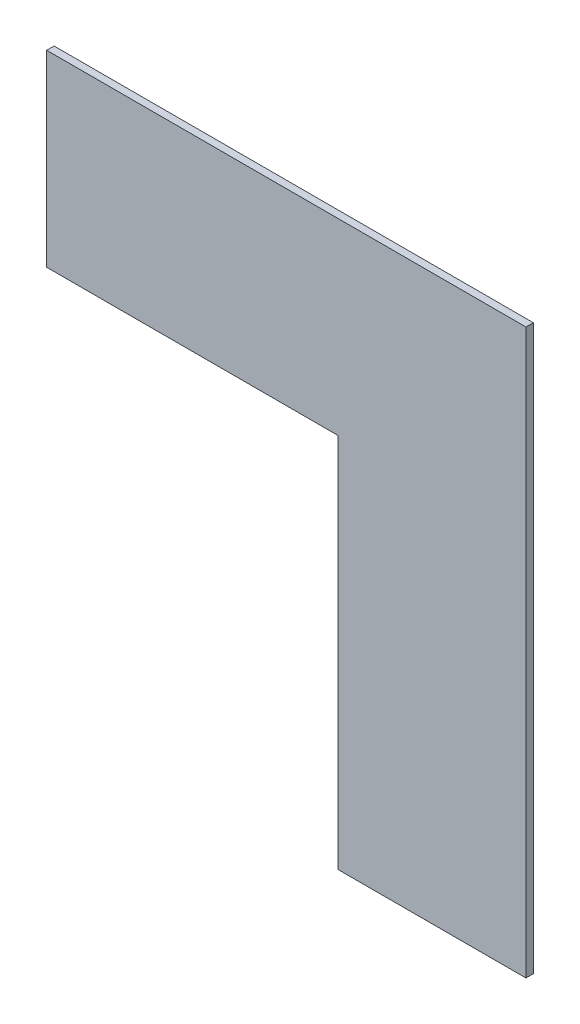
ISO-10303-21;
HEADER;
FILE_DESCRIPTION(('STEP AP214'),'2;1');
FILE_NAME('part.step','',(''),(''),'','','');
FILE_SCHEMA(('AUTOMOTIVE_DESIGN { 1 0 10303 214 1 1 1 1 }'));
ENDSEC;
DATA;
#1=APPLICATION_CONTEXT('core data for automotive mechanical design processes');
#2=APPLICATION_PROTOCOL_DEFINITION('international standard','automotive_design',2000,#1);
#3=PRODUCT_CONTEXT('',#1,'mechanical');
#4=PRODUCT('Part','Part','',(#3));
#5=PRODUCT_RELATED_PRODUCT_CATEGORY('part','',(#4));
#6=PRODUCT_DEFINITION_FORMATION('','',#4);
#7=PRODUCT_DEFINITION_CONTEXT('part definition',#1,'design');
#8=PRODUCT_DEFINITION('design','',#6,#7);
#9=PRODUCT_DEFINITION_SHAPE('','',#8);
#10=(LENGTH_UNIT() NAMED_UNIT(*) SI_UNIT(.MILLI.,.METRE.));
#11=(NAMED_UNIT(*) PLANE_ANGLE_UNIT() SI_UNIT($,.RADIAN.));
#12=(NAMED_UNIT(*) SI_UNIT($,.STERADIAN.) SOLID_ANGLE_UNIT());
#13=UNCERTAINTY_MEASURE_WITH_UNIT(LENGTH_MEASURE(1.E-05),#10,'distance_accuracy_value','');
#14=(GEOMETRIC_REPRESENTATION_CONTEXT(3) GLOBAL_UNCERTAINTY_ASSIGNED_CONTEXT((#13)) GLOBAL_UNIT_ASSIGNED_CONTEXT((#10,
#11,#12)) REPRESENTATION_CONTEXT('',''));
#15=CARTESIAN_POINT('',(0.,0.,0.));
#16=DIRECTION('',(0.,0.,1.));
#17=DIRECTION('',(1.,0.,0.));
#18=AXIS2_PLACEMENT_3D('',#15,#16,#17);
#19=CARTESIAN_POINT('',(-0.32385,0.381,0.01));
#20=DIRECTION('',(0.,0.,1.));
#21=DIRECTION('',(1.,0.,0.));
#22=AXIS2_PLACEMENT_3D('',#19,#20,#21);
#23=PLANE('',#22);
#24=DIRECTION('',(0.,1.,0.));
#25=VECTOR('',#24,1.);
#26=CARTESIAN_POINT('',(0.32385,0.381,0.01));
#27=LINE('',#26,#25);
#28=CARTESIAN_POINT('',(0.32385,0.381,0.01));
#29=VERTEX_POINT('',#28);
#30=CARTESIAN_POINT('',(0.32385,-0.381,0.01));
#31=VERTEX_POINT('',#30);
#32=EDGE_CURVE('E97',#29,#31,#27,.F.);
#33=ORIENTED_EDGE('',*,*,#32,.F.);
#34=DIRECTION('',(1.,0.,0.));
#35=VECTOR('',#34,1.);
#36=CARTESIAN_POINT('',(-0.32385,0.381,0.01));
#37=LINE('',#36,#35);
#38=CARTESIAN_POINT('',(-0.32385,0.381,0.01));
#39=VERTEX_POINT('',#38);
#40=EDGE_CURVE('E82',#39,#29,#37,.T.);
#41=ORIENTED_EDGE('',*,*,#40,.F.);
#42=DIRECTION('',(0.,1.,0.));
#43=VECTOR('',#42,1.);
#44=CARTESIAN_POINT('',(-0.32385,0.127,0.01));
#45=LINE('',#44,#43);
#46=CARTESIAN_POINT('',(-0.32385,0.127,0.01));
#47=VERTEX_POINT('',#46);
#48=EDGE_CURVE('E20',#47,#39,#45,.T.);
#49=ORIENTED_EDGE('',*,*,#48,.F.);
#50=DIRECTION('',(1.,0.,0.));
#51=VECTOR('',#50,1.);
#52=CARTESIAN_POINT('',(0.06985,0.127,0.01));
#53=LINE('',#52,#51);
#54=CARTESIAN_POINT('',(0.06985,0.127,0.01));
#55=VERTEX_POINT('',#54);
#56=EDGE_CURVE('E71',#55,#47,#53,.F.);
#57=ORIENTED_EDGE('',*,*,#56,.F.);
#58=DIRECTION('',(0.,1.,0.));
#59=VECTOR('',#58,1.);
#60=CARTESIAN_POINT('',(0.06985,-0.381,0.01));
#61=LINE('',#60,#59);
#62=CARTESIAN_POINT('',(0.06985,-0.381,0.01));
#63=VERTEX_POINT('',#62);
#64=EDGE_CURVE('E66',#63,#55,#61,.T.);
#65=ORIENTED_EDGE('',*,*,#64,.F.);
#66=DIRECTION('',(1.,0.,0.));
#67=VECTOR('',#66,1.);
#68=CARTESIAN_POINT('',(0.32385,-0.381,0.01));
#69=LINE('',#68,#67);
#70=EDGE_CURVE('E93',#31,#63,#69,.F.);
#71=ORIENTED_EDGE('',*,*,#70,.F.);
#72=EDGE_LOOP('',(#33,#41,#49,#57,#65,#71));
#73=FACE_BOUND('',#72,.T.);
#74=ADVANCED_FACE('F17',(#73),#23,.T.);
#75=CARTESIAN_POINT('',(-0.32385,0.127,0.));
#76=DIRECTION('',(-1.,0.,0.));
#77=DIRECTION('',(0.,0.,1.));
#78=AXIS2_PLACEMENT_3D('',#75,#76,#77);
#79=PLANE('',#78);
#80=DIRECTION('',(0.,0.,1.));
#81=VECTOR('',#80,1.);
#82=CARTESIAN_POINT('',(-0.32385,0.381,0.));
#83=LINE('',#82,#81);
#84=CARTESIAN_POINT('',(-0.32385,0.381,0.));
#85=VERTEX_POINT('',#84);
#86=EDGE_CURVE('E101',#85,#39,#83,.T.);
#87=ORIENTED_EDGE('',*,*,#86,.F.);
#88=DIRECTION('',(0.,1.,0.));
#89=VECTOR('',#88,1.);
#90=CARTESIAN_POINT('',(-0.32385,0.381,0.));
#91=LINE('',#90,#89);
#92=CARTESIAN_POINT('',(-0.32385,0.127,0.));
#93=VERTEX_POINT('',#92);
#94=EDGE_CURVE('E88',#85,#93,#91,.F.);
#95=ORIENTED_EDGE('',*,*,#94,.T.);
#96=DIRECTION('',(0.,0.,-1.));
#97=VECTOR('',#96,1.);
#98=CARTESIAN_POINT('',(-0.32385,0.127,0.));
#99=LINE('',#98,#97);
#100=EDGE_CURVE('E76',#47,#93,#99,.T.);
#101=ORIENTED_EDGE('',*,*,#100,.F.);
#102=ORIENTED_EDGE('',*,*,#48,.T.);
#103=EDGE_LOOP('',(#87,#95,#101,#102));
#104=FACE_BOUND('',#103,.T.);
#105=ADVANCED_FACE('F87',(#104),#79,.T.);
#106=CARTESIAN_POINT('',(0.06985,0.127,0.));
#107=DIRECTION('',(0.,-1.,0.));
#108=DIRECTION('',(0.,0.,-1.));
#109=AXIS2_PLACEMENT_3D('',#106,#107,#108);
#110=PLANE('',#109);
#111=ORIENTED_EDGE('',*,*,#100,.T.);
#112=DIRECTION('',(1.,0.,0.));
#113=VECTOR('',#112,1.);
#114=CARTESIAN_POINT('',(-0.32385,0.127,0.));
#115=LINE('',#114,#113);
#116=CARTESIAN_POINT('',(0.06985,0.127,0.));
#117=VERTEX_POINT('',#116);
#118=EDGE_CURVE('E106',#93,#117,#115,.T.);
#119=ORIENTED_EDGE('',*,*,#118,.T.);
#120=DIRECTION('',(0.,0.,1.));
#121=VECTOR('',#120,1.);
#122=CARTESIAN_POINT('',(0.06985,0.127,0.));
#123=LINE('',#122,#121);
#124=EDGE_CURVE('E78',#55,#117,#123,.F.);
#125=ORIENTED_EDGE('',*,*,#124,.F.);
#126=ORIENTED_EDGE('',*,*,#56,.T.);
#127=EDGE_LOOP('',(#111,#119,#125,#126));
#128=FACE_BOUND('',#127,.T.);
#129=ADVANCED_FACE('F73',(#128),#110,.T.);
#130=CARTESIAN_POINT('',(0.06985,-0.381,0.));
#131=DIRECTION('',(-1.,0.,0.));
#132=DIRECTION('',(0.,0.,1.));
#133=AXIS2_PLACEMENT_3D('',#130,#131,#132);
#134=PLANE('',#133);
#135=ORIENTED_EDGE('',*,*,#124,.T.);
#136=DIRECTION('',(0.,1.,0.));
#137=VECTOR('',#136,1.);
#138=CARTESIAN_POINT('',(0.06985,0.381,0.));
#139=LINE('',#138,#137);
#140=CARTESIAN_POINT('',(0.06985,-0.381,0.));
#141=VERTEX_POINT('',#140);
#142=EDGE_CURVE('E108',#117,#141,#139,.F.);
#143=ORIENTED_EDGE('',*,*,#142,.T.);
#144=DIRECTION('',(0.,0.,-1.));
#145=VECTOR('',#144,1.);
#146=CARTESIAN_POINT('',(0.06985,-0.381,0.));
#147=LINE('',#146,#145);
#148=EDGE_CURVE('E95',#63,#141,#147,.T.);
#149=ORIENTED_EDGE('',*,*,#148,.F.);
#150=ORIENTED_EDGE('',*,*,#64,.T.);
#151=EDGE_LOOP('',(#135,#143,#149,#150));
#152=FACE_BOUND('',#151,.T.);
#153=ADVANCED_FACE('F126',(#152),#134,.T.);
#154=CARTESIAN_POINT('',(0.32385,-0.381,0.));
#155=DIRECTION('',(0.,-1.,0.));
#156=DIRECTION('',(0.,0.,-1.));
#157=AXIS2_PLACEMENT_3D('',#154,#155,#156);
#158=PLANE('',#157);
#159=ORIENTED_EDGE('',*,*,#148,.T.);
#160=DIRECTION('',(1.,0.,0.));
#161=VECTOR('',#160,1.);
#162=CARTESIAN_POINT('',(-0.32385,-0.381,0.));
#163=LINE('',#162,#161);
#164=CARTESIAN_POINT('',(0.32385,-0.381,0.));
#165=VERTEX_POINT('',#164);
#166=EDGE_CURVE('E111',#141,#165,#163,.T.);
#167=ORIENTED_EDGE('',*,*,#166,.T.);
#168=DIRECTION('',(0.,0.,-1.));
#169=VECTOR('',#168,1.);
#170=CARTESIAN_POINT('',(0.32385,-0.381,0.));
#171=LINE('',#170,#169);
#172=EDGE_CURVE('E99',#31,#165,#171,.T.);
#173=ORIENTED_EDGE('',*,*,#172,.F.);
#174=ORIENTED_EDGE('',*,*,#70,.T.);
#175=EDGE_LOOP('',(#159,#167,#173,#174));
#176=FACE_BOUND('',#175,.T.);
#177=ADVANCED_FACE('F124',(#176),#158,.T.);
#178=CARTESIAN_POINT('',(0.32385,0.381,0.));
#179=DIRECTION('',(1.,0.,0.));
#180=DIRECTION('',(0.,0.,-1.));
#181=AXIS2_PLACEMENT_3D('',#178,#179,#180);
#182=PLANE('',#181);
#183=ORIENTED_EDGE('',*,*,#172,.T.);
#184=DIRECTION('',(0.,1.,0.));
#185=VECTOR('',#184,1.);
#186=CARTESIAN_POINT('',(0.32385,0.381,0.));
#187=LINE('',#186,#185);
#188=CARTESIAN_POINT('',(0.32385,0.381,0.));
#189=VERTEX_POINT('',#188);
#190=EDGE_CURVE('E26',#165,#189,#187,.T.);
#191=ORIENTED_EDGE('',*,*,#190,.T.);
#192=DIRECTION('',(0.,0.,1.));
#193=VECTOR('',#192,1.);
#194=CARTESIAN_POINT('',(0.32385,0.381,0.));
#195=LINE('',#194,#193);
#196=EDGE_CURVE('E34',#29,#189,#195,.F.);
#197=ORIENTED_EDGE('',*,*,#196,.F.);
#198=ORIENTED_EDGE('',*,*,#32,.T.);
#199=EDGE_LOOP('',(#183,#191,#197,#198));
#200=FACE_BOUND('',#199,.T.);
#201=ADVANCED_FACE('F117',(#200),#182,.T.);
#202=CARTESIAN_POINT('',(-0.32385,0.381,0.));
#203=DIRECTION('',(0.,1.,0.));
#204=DIRECTION('',(0.,0.,1.));
#205=AXIS2_PLACEMENT_3D('',#202,#203,#204);
#206=PLANE('',#205);
#207=ORIENTED_EDGE('',*,*,#196,.T.);
#208=DIRECTION('',(1.,0.,0.));
#209=VECTOR('',#208,1.);
#210=CARTESIAN_POINT('',(-0.32385,0.381,0.));
#211=LINE('',#210,#209);
#212=EDGE_CURVE('E11',#189,#85,#211,.F.);
#213=ORIENTED_EDGE('',*,*,#212,.T.);
#214=ORIENTED_EDGE('',*,*,#86,.T.);
#215=ORIENTED_EDGE('',*,*,#40,.T.);
#216=EDGE_LOOP('',(#207,#213,#214,#215));
#217=FACE_BOUND('',#216,.T.);
#218=ADVANCED_FACE('F127',(#217),#206,.T.);
#219=CARTESIAN_POINT('',(-0.32385,0.381,0.));
#220=DIRECTION('',(0.,0.,1.));
#221=DIRECTION('',(1.,0.,0.));
#222=AXIS2_PLACEMENT_3D('',#219,#220,#221);
#223=PLANE('',#222);
#224=ORIENTED_EDGE('',*,*,#190,.F.);
#225=ORIENTED_EDGE('',*,*,#166,.F.);
#226=ORIENTED_EDGE('',*,*,#142,.F.);
#227=ORIENTED_EDGE('',*,*,#118,.F.);
#228=ORIENTED_EDGE('',*,*,#94,.F.);
#229=ORIENTED_EDGE('',*,*,#212,.F.);
#230=EDGE_LOOP('',(#224,#225,#226,#227,#228,#229));
#231=FACE_BOUND('',#230,.T.);
#232=ADVANCED_FACE('F121',(#231),#223,.F.);
#233=CLOSED_SHELL('',(#74,#105,#129,#153,#177,#201,#218,#232));
#234=MANIFOLD_SOLID_BREP('B1',#233);
#235=ADVANCED_BREP_SHAPE_REPRESENTATION('',(#18,#234),#14);
#236=SHAPE_DEFINITION_REPRESENTATION(#9,#235);
ENDSEC;
END-ISO-10303-21;
